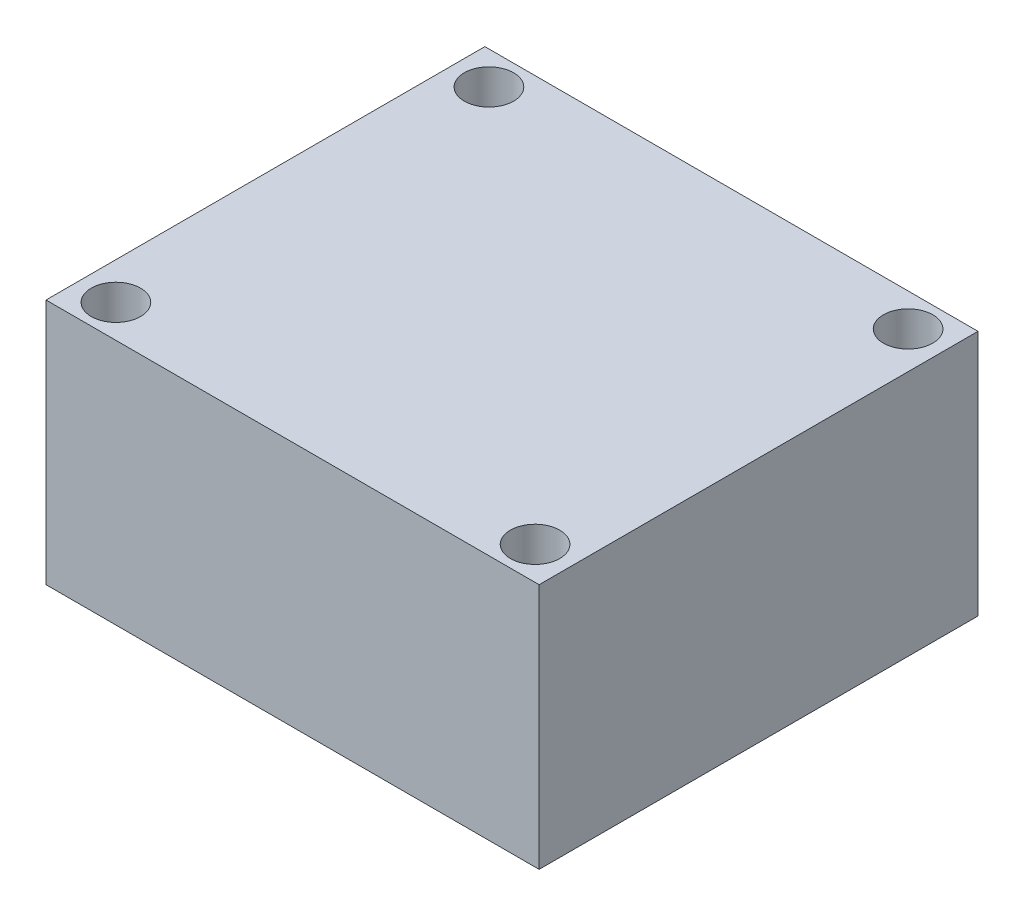
ISO-10303-21;
HEADER;
FILE_DESCRIPTION(('STEP AP214'),'2;1');
FILE_NAME('part.step','',(''),(''),'','','');
FILE_SCHEMA(('AUTOMOTIVE_DESIGN { 1 0 10303 214 1 1 1 1 }'));
ENDSEC;
DATA;
#1=APPLICATION_CONTEXT('core data for automotive mechanical design processes');
#2=APPLICATION_PROTOCOL_DEFINITION('international standard','automotive_design',2000,#1);
#3=PRODUCT_CONTEXT('',#1,'mechanical');
#4=PRODUCT('Part','Part','',(#3));
#5=PRODUCT_RELATED_PRODUCT_CATEGORY('part','',(#4));
#6=PRODUCT_DEFINITION_FORMATION('','',#4);
#7=PRODUCT_DEFINITION_CONTEXT('part definition',#1,'design');
#8=PRODUCT_DEFINITION('design','',#6,#7);
#9=PRODUCT_DEFINITION_SHAPE('','',#8);
#10=(LENGTH_UNIT() NAMED_UNIT(*) SI_UNIT(.MILLI.,.METRE.));
#11=(NAMED_UNIT(*) PLANE_ANGLE_UNIT() SI_UNIT($,.RADIAN.));
#12=(NAMED_UNIT(*) SI_UNIT($,.STERADIAN.) SOLID_ANGLE_UNIT());
#13=UNCERTAINTY_MEASURE_WITH_UNIT(LENGTH_MEASURE(1.E-05),#10,'distance_accuracy_value','');
#14=(GEOMETRIC_REPRESENTATION_CONTEXT(3) GLOBAL_UNCERTAINTY_ASSIGNED_CONTEXT((#13)) GLOBAL_UNIT_ASSIGNED_CONTEXT((#10,
#11,#12)) REPRESENTATION_CONTEXT('',''));
#15=CARTESIAN_POINT('',(0.,0.,0.));
#16=DIRECTION('',(0.,0.,1.));
#17=DIRECTION('',(1.,0.,0.));
#18=AXIS2_PLACEMENT_3D('',#15,#16,#17);
#19=CARTESIAN_POINT('',(0.,10.,0.));
#20=DIRECTION('',(0.,-1.,0.));
#21=DIRECTION('',(0.,0.,-1.));
#22=AXIS2_PLACEMENT_3D('',#19,#20,#21);
#23=PLANE('',#22);
#24=DIRECTION('',(0.,0.,1.));
#25=VECTOR('',#24,1.);
#26=CARTESIAN_POINT('',(0.,10.,0.));
#27=LINE('',#26,#25);
#28=CARTESIAN_POINT('',(0.,10.,-17.8));
#29=VERTEX_POINT('',#28);
#30=CARTESIAN_POINT('',(0.,10.,0.));
#31=VERTEX_POINT('',#30);
#32=EDGE_CURVE('E87',#29,#31,#27,.T.);
#33=ORIENTED_EDGE('',*,*,#32,.T.);
#34=DIRECTION('',(1.,0.,0.));
#35=VECTOR('',#34,1.);
#36=CARTESIAN_POINT('',(0.,10.,0.));
#37=LINE('',#36,#35);
#38=CARTESIAN_POINT('',(20.,10.,0.));
#39=VERTEX_POINT('',#38);
#40=EDGE_CURVE('E82',#31,#39,#37,.T.);
#41=ORIENTED_EDGE('',*,*,#40,.T.);
#42=DIRECTION('',(0.,0.,-1.));
#43=VECTOR('',#42,1.);
#44=CARTESIAN_POINT('',(20.,10.,0.));
#45=LINE('',#44,#43);
#46=CARTESIAN_POINT('',(20.,10.,-17.8));
#47=VERTEX_POINT('',#46);
#48=EDGE_CURVE('E85',#39,#47,#45,.T.);
#49=ORIENTED_EDGE('',*,*,#48,.T.);
#50=DIRECTION('',(-1.,0.,0.));
#51=VECTOR('',#50,1.);
#52=CARTESIAN_POINT('',(0.,10.,-17.8));
#53=LINE('',#52,#51);
#54=EDGE_CURVE('E52',#47,#29,#53,.T.);
#55=ORIENTED_EDGE('',*,*,#54,.T.);
#56=EDGE_LOOP('',(#33,#41,#49,#55));
#57=FACE_BOUND('',#56,.T.);
#58=CARTESIAN_POINT('',(1.5,10.,-16.465));
#59=DIRECTION('',(0.,1.,0.));
#60=DIRECTION('',(0.,0.,1.));
#61=AXIS2_PLACEMENT_3D('',#58,#59,#60);
#62=CIRCLE('',#61,1.);
#63=CARTESIAN_POINT('',(1.5,10.,-15.465));
#64=VERTEX_POINT('',#63);
#65=EDGE_CURVE('E102',#64,#64,#62,.T.);
#66=ORIENTED_EDGE('',*,*,#65,.F.);
#67=EDGE_LOOP('',(#66));
#68=FACE_BOUND('',#67,.T.);
#69=CARTESIAN_POINT('',(1.5,10.,-1.335));
#70=DIRECTION('',(0.,1.,0.));
#71=DIRECTION('',(0.,0.,1.));
#72=AXIS2_PLACEMENT_3D('',#69,#70,#71);
#73=CIRCLE('',#72,1.);
#74=CARTESIAN_POINT('',(1.5,10.,-0.335));
#75=VERTEX_POINT('',#74);
#76=EDGE_CURVE('E117',#75,#75,#73,.T.);
#77=ORIENTED_EDGE('',*,*,#76,.F.);
#78=EDGE_LOOP('',(#77));
#79=FACE_BOUND('',#78,.T.);
#80=CARTESIAN_POINT('',(18.5000000000001,10.,-1.33500000000006));
#81=DIRECTION('',(0.,1.,0.));
#82=DIRECTION('',(0.,0.,-1.));
#83=AXIS2_PLACEMENT_3D('',#80,#81,#82);
#84=CIRCLE('',#83,0.999999999999999);
#85=CARTESIAN_POINT('',(18.5000000000001,10.,-2.33500000000006));
#86=VERTEX_POINT('',#85);
#87=EDGE_CURVE('E123',#86,#86,#84,.T.);
#88=ORIENTED_EDGE('',*,*,#87,.F.);
#89=EDGE_LOOP('',(#88));
#90=FACE_BOUND('',#89,.T.);
#91=CARTESIAN_POINT('',(18.5,10.,-16.4650000000001));
#92=DIRECTION('',(0.,1.,0.));
#93=DIRECTION('',(0.,0.,-1.));
#94=AXIS2_PLACEMENT_3D('',#91,#92,#93);
#95=CIRCLE('',#94,1.);
#96=CARTESIAN_POINT('',(18.5,10.,-17.4650000000001));
#97=VERTEX_POINT('',#96);
#98=EDGE_CURVE('E129',#97,#97,#95,.T.);
#99=ORIENTED_EDGE('',*,*,#98,.F.);
#100=EDGE_LOOP('',(#99));
#101=FACE_BOUND('',#100,.T.);
#102=ADVANCED_FACE('F35',(#57,#68,#79,#90,#101),#23,.F.);
#103=CARTESIAN_POINT('',(0.,0.,0.));
#104=DIRECTION('',(0.,-1.,0.));
#105=DIRECTION('',(0.,0.,-1.));
#106=AXIS2_PLACEMENT_3D('',#103,#104,#105);
#107=PLANE('',#106);
#108=CARTESIAN_POINT('',(18.5000000000001,0.,-1.33500000000006));
#109=DIRECTION('',(0.,1.,0.));
#110=DIRECTION('',(0.,0.,-1.));
#111=AXIS2_PLACEMENT_3D('',#108,#109,#110);
#112=CIRCLE('',#111,0.999999999999999);
#113=CARTESIAN_POINT('',(18.5000000000001,0.,-2.33500000000006));
#114=VERTEX_POINT('',#113);
#115=EDGE_CURVE('E126',#114,#114,#112,.T.);
#116=ORIENTED_EDGE('',*,*,#115,.T.);
#117=EDGE_LOOP('',(#116));
#118=FACE_BOUND('',#117,.T.);
#119=CARTESIAN_POINT('',(1.5,0.,-16.465));
#120=DIRECTION('',(0.,1.,0.));
#121=DIRECTION('',(0.,0.,1.));
#122=AXIS2_PLACEMENT_3D('',#119,#120,#121);
#123=CIRCLE('',#122,1.);
#124=CARTESIAN_POINT('',(1.5,0.,-15.465));
#125=VERTEX_POINT('',#124);
#126=EDGE_CURVE('E114',#125,#125,#123,.T.);
#127=ORIENTED_EDGE('',*,*,#126,.T.);
#128=EDGE_LOOP('',(#127));
#129=FACE_BOUND('',#128,.T.);
#130=DIRECTION('',(0.,0.,1.));
#131=VECTOR('',#130,1.);
#132=CARTESIAN_POINT('',(0.,0.,0.));
#133=LINE('',#132,#131);
#134=CARTESIAN_POINT('',(0.,0.,-17.8));
#135=VERTEX_POINT('',#134);
#136=CARTESIAN_POINT('',(0.,0.,0.));
#137=VERTEX_POINT('',#136);
#138=EDGE_CURVE('E99',#135,#137,#133,.T.);
#139=ORIENTED_EDGE('',*,*,#138,.F.);
#140=DIRECTION('',(-1.,0.,0.));
#141=VECTOR('',#140,1.);
#142=CARTESIAN_POINT('',(0.,0.,-17.8));
#143=LINE('',#142,#141);
#144=CARTESIAN_POINT('',(20.,0.,-17.8));
#145=VERTEX_POINT('',#144);
#146=EDGE_CURVE('E75',#145,#135,#143,.T.);
#147=ORIENTED_EDGE('',*,*,#146,.F.);
#148=DIRECTION('',(0.,0.,-1.));
#149=VECTOR('',#148,1.);
#150=CARTESIAN_POINT('',(20.,0.,0.));
#151=LINE('',#150,#149);
#152=CARTESIAN_POINT('',(20.,0.,0.));
#153=VERTEX_POINT('',#152);
#154=EDGE_CURVE('E69',#153,#145,#151,.T.);
#155=ORIENTED_EDGE('',*,*,#154,.F.);
#156=DIRECTION('',(1.,0.,0.));
#157=VECTOR('',#156,1.);
#158=CARTESIAN_POINT('',(0.,0.,0.));
#159=LINE('',#158,#157);
#160=EDGE_CURVE('E91',#137,#153,#159,.T.);
#161=ORIENTED_EDGE('',*,*,#160,.F.);
#162=EDGE_LOOP('',(#139,#147,#155,#161));
#163=FACE_BOUND('',#162,.T.);
#164=CARTESIAN_POINT('',(1.5,0.,-1.335));
#165=DIRECTION('',(0.,1.,0.));
#166=DIRECTION('',(0.,0.,1.));
#167=AXIS2_PLACEMENT_3D('',#164,#165,#166);
#168=CIRCLE('',#167,1.);
#169=CARTESIAN_POINT('',(1.5,0.,-0.335));
#170=VERTEX_POINT('',#169);
#171=EDGE_CURVE('E120',#170,#170,#168,.T.);
#172=ORIENTED_EDGE('',*,*,#171,.T.);
#173=EDGE_LOOP('',(#172));
#174=FACE_BOUND('',#173,.T.);
#175=CARTESIAN_POINT('',(18.5,0.,-16.4650000000001));
#176=DIRECTION('',(0.,1.,0.));
#177=DIRECTION('',(0.,0.,-1.));
#178=AXIS2_PLACEMENT_3D('',#175,#176,#177);
#179=CIRCLE('',#178,1.);
#180=CARTESIAN_POINT('',(18.5,0.,-17.4650000000001));
#181=VERTEX_POINT('',#180);
#182=EDGE_CURVE('E132',#181,#181,#179,.T.);
#183=ORIENTED_EDGE('',*,*,#182,.T.);
#184=EDGE_LOOP('',(#183));
#185=FACE_BOUND('',#184,.T.);
#186=ADVANCED_FACE('F110',(#118,#129,#163,#174,#185),#107,.T.);
#187=CARTESIAN_POINT('',(0.,10.,0.));
#188=DIRECTION('',(1.,0.,0.));
#189=DIRECTION('',(0.,0.,-1.));
#190=AXIS2_PLACEMENT_3D('',#187,#188,#189);
#191=PLANE('',#190);
#192=ORIENTED_EDGE('',*,*,#138,.T.);
#193=DIRECTION('',(0.,-1.,0.));
#194=VECTOR('',#193,1.);
#195=CARTESIAN_POINT('',(0.,10.,0.));
#196=LINE('',#195,#194);
#197=EDGE_CURVE('E11',#31,#137,#196,.T.);
#198=ORIENTED_EDGE('',*,*,#197,.F.);
#199=ORIENTED_EDGE('',*,*,#32,.F.);
#200=DIRECTION('',(0.,-1.,0.));
#201=VECTOR('',#200,1.);
#202=CARTESIAN_POINT('',(0.,10.,-17.8));
#203=LINE('',#202,#201);
#204=EDGE_CURVE('E95',#29,#135,#203,.T.);
#205=ORIENTED_EDGE('',*,*,#204,.T.);
#206=EDGE_LOOP('',(#192,#198,#199,#205));
#207=FACE_BOUND('',#206,.T.);
#208=ADVANCED_FACE('F37',(#207),#191,.F.);
#209=CARTESIAN_POINT('',(0.,10.,0.));
#210=DIRECTION('',(0.,0.,-1.));
#211=DIRECTION('',(-1.,0.,0.));
#212=AXIS2_PLACEMENT_3D('',#209,#210,#211);
#213=PLANE('',#212);
#214=ORIENTED_EDGE('',*,*,#160,.T.);
#215=DIRECTION('',(0.,-1.,0.));
#216=VECTOR('',#215,1.);
#217=CARTESIAN_POINT('',(20.,10.,0.));
#218=LINE('',#217,#216);
#219=EDGE_CURVE('E44',#39,#153,#218,.T.);
#220=ORIENTED_EDGE('',*,*,#219,.F.);
#221=ORIENTED_EDGE('',*,*,#40,.F.);
#222=ORIENTED_EDGE('',*,*,#197,.T.);
#223=EDGE_LOOP('',(#214,#220,#221,#222));
#224=FACE_BOUND('',#223,.T.);
#225=ADVANCED_FACE('F90',(#224),#213,.F.);
#226=CARTESIAN_POINT('',(20.,10.,0.));
#227=DIRECTION('',(-1.,0.,0.));
#228=DIRECTION('',(0.,0.,1.));
#229=AXIS2_PLACEMENT_3D('',#226,#227,#228);
#230=PLANE('',#229);
#231=ORIENTED_EDGE('',*,*,#154,.T.);
#232=DIRECTION('',(0.,-1.,0.));
#233=VECTOR('',#232,1.);
#234=CARTESIAN_POINT('',(20.,10.,-17.8));
#235=LINE('',#234,#233);
#236=EDGE_CURVE('E92',#47,#145,#235,.T.);
#237=ORIENTED_EDGE('',*,*,#236,.F.);
#238=ORIENTED_EDGE('',*,*,#48,.F.);
#239=ORIENTED_EDGE('',*,*,#219,.T.);
#240=EDGE_LOOP('',(#231,#237,#238,#239));
#241=FACE_BOUND('',#240,.T.);
#242=ADVANCED_FACE('F93',(#241),#230,.F.);
#243=CARTESIAN_POINT('',(0.,10.,-17.8));
#244=DIRECTION('',(0.,0.,1.));
#245=DIRECTION('',(1.,0.,0.));
#246=AXIS2_PLACEMENT_3D('',#243,#244,#245);
#247=PLANE('',#246);
#248=ORIENTED_EDGE('',*,*,#146,.T.);
#249=ORIENTED_EDGE('',*,*,#204,.F.);
#250=ORIENTED_EDGE('',*,*,#54,.F.);
#251=ORIENTED_EDGE('',*,*,#236,.T.);
#252=EDGE_LOOP('',(#248,#249,#250,#251));
#253=FACE_BOUND('',#252,.T.);
#254=ADVANCED_FACE('F107',(#253),#247,.F.);
#255=CARTESIAN_POINT('',(1.5,10.,-16.465));
#256=DIRECTION('',(0.,-1.,0.));
#257=DIRECTION('',(0.,0.,-1.));
#258=AXIS2_PLACEMENT_3D('',#255,#256,#257);
#259=CYLINDRICAL_SURFACE('',#258,1.);
#260=ORIENTED_EDGE('',*,*,#65,.T.);
#261=EDGE_LOOP('',(#260));
#262=FACE_BOUND('',#261,.T.);
#263=ORIENTED_EDGE('',*,*,#126,.F.);
#264=EDGE_LOOP('',(#263));
#265=FACE_BOUND('',#264,.T.);
#266=ADVANCED_FACE('F149',(#262,#265),#259,.F.);
#267=CARTESIAN_POINT('',(1.5,10.,-1.335));
#268=DIRECTION('',(0.,-1.,0.));
#269=DIRECTION('',(0.,0.,-1.));
#270=AXIS2_PLACEMENT_3D('',#267,#268,#269);
#271=CYLINDRICAL_SURFACE('',#270,1.);
#272=ORIENTED_EDGE('',*,*,#76,.T.);
#273=EDGE_LOOP('',(#272));
#274=FACE_BOUND('',#273,.T.);
#275=ORIENTED_EDGE('',*,*,#171,.F.);
#276=EDGE_LOOP('',(#275));
#277=FACE_BOUND('',#276,.T.);
#278=ADVANCED_FACE('F195',(#274,#277),#271,.F.);
#279=CARTESIAN_POINT('',(18.5000000000001,10.,-1.33500000000006));
#280=DIRECTION('',(0.,-1.,0.));
#281=DIRECTION('',(0.,0.,-1.));
#282=AXIS2_PLACEMENT_3D('',#279,#280,#281);
#283=CYLINDRICAL_SURFACE('',#282,0.999999999999999);
#284=ORIENTED_EDGE('',*,*,#87,.T.);
#285=EDGE_LOOP('',(#284));
#286=FACE_BOUND('',#285,.T.);
#287=ORIENTED_EDGE('',*,*,#115,.F.);
#288=EDGE_LOOP('',(#287));
#289=FACE_BOUND('',#288,.T.);
#290=ADVANCED_FACE('F203',(#286,#289),#283,.F.);
#291=CARTESIAN_POINT('',(18.5,10.,-16.4650000000001));
#292=DIRECTION('',(0.,-1.,0.));
#293=DIRECTION('',(0.,0.,-1.));
#294=AXIS2_PLACEMENT_3D('',#291,#292,#293);
#295=CYLINDRICAL_SURFACE('',#294,1.);
#296=ORIENTED_EDGE('',*,*,#98,.T.);
#297=EDGE_LOOP('',(#296));
#298=FACE_BOUND('',#297,.T.);
#299=ORIENTED_EDGE('',*,*,#182,.F.);
#300=EDGE_LOOP('',(#299));
#301=FACE_BOUND('',#300,.T.);
#302=ADVANCED_FACE('F138',(#298,#301),#295,.F.);
#303=CLOSED_SHELL('',(#102,#186,#208,#225,#242,#254,#266,#278,#290,#302));
#304=MANIFOLD_SOLID_BREP('B2',#303);
#305=ADVANCED_BREP_SHAPE_REPRESENTATION('',(#18,#304),#14);
#306=SHAPE_DEFINITION_REPRESENTATION(#9,#305);
ENDSEC;
END-ISO-10303-21;
